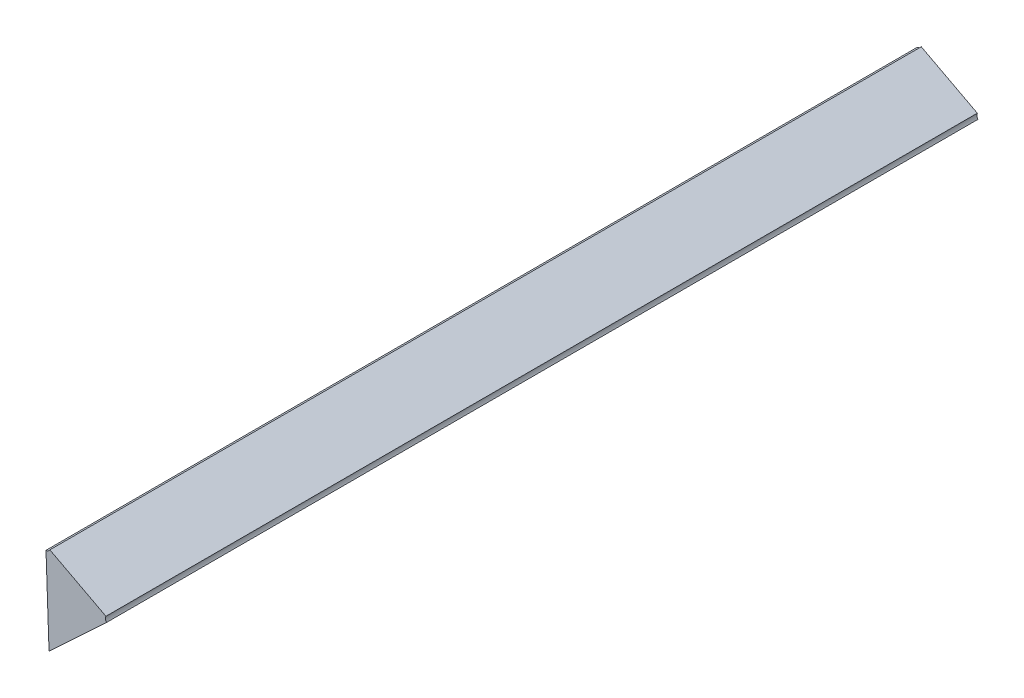
ISO-10303-21;
HEADER;
FILE_DESCRIPTION(('STEP AP214'),'2;1');
FILE_NAME('part.step','',(''),(''),'','','');
FILE_SCHEMA(('AUTOMOTIVE_DESIGN { 1 0 10303 214 1 1 1 1 }'));
ENDSEC;
DATA;
#1=APPLICATION_CONTEXT('core data for automotive mechanical design processes');
#2=APPLICATION_PROTOCOL_DEFINITION('international standard','automotive_design',2000,#1);
#3=PRODUCT_CONTEXT('',#1,'mechanical');
#4=PRODUCT('Part','Part','',(#3));
#5=PRODUCT_RELATED_PRODUCT_CATEGORY('part','',(#4));
#6=PRODUCT_DEFINITION_FORMATION('','',#4);
#7=PRODUCT_DEFINITION_CONTEXT('part definition',#1,'design');
#8=PRODUCT_DEFINITION('design','',#6,#7);
#9=PRODUCT_DEFINITION_SHAPE('','',#8);
#10=(LENGTH_UNIT() NAMED_UNIT(*) SI_UNIT(.MILLI.,.METRE.));
#11=(NAMED_UNIT(*) PLANE_ANGLE_UNIT() SI_UNIT($,.RADIAN.));
#12=(NAMED_UNIT(*) SI_UNIT($,.STERADIAN.) SOLID_ANGLE_UNIT());
#13=UNCERTAINTY_MEASURE_WITH_UNIT(LENGTH_MEASURE(1.E-05),#10,'distance_accuracy_value','');
#14=(GEOMETRIC_REPRESENTATION_CONTEXT(3) GLOBAL_UNCERTAINTY_ASSIGNED_CONTEXT((#13)) GLOBAL_UNIT_ASSIGNED_CONTEXT((#10,
#11,#12)) REPRESENTATION_CONTEXT('',''));
#15=CARTESIAN_POINT('',(0.,0.,0.));
#16=DIRECTION('',(0.,0.,1.));
#17=DIRECTION('',(1.,0.,0.));
#18=AXIS2_PLACEMENT_3D('',#15,#16,#17);
#19=CARTESIAN_POINT('',(-1.2992040822609,-0.38468925183984,0.));
#20=DIRECTION('',(0.,0.,-1.));
#21=DIRECTION('',(-1.,0.,0.));
#22=AXIS2_PLACEMENT_3D('',#19,#20,#21);
#23=PLANE('',#22);
#24=DIRECTION('',(0.,1.,0.));
#25=VECTOR('',#24,1.);
#26=CARTESIAN_POINT('',(-1.301513234463,-0.390354849213328,0.));
#27=LINE('',#26,#25);
#28=CARTESIAN_POINT('',(-1.3011633748782,-0.390006506078917,0.));
#29=VERTEX_POINT('',#28);
#30=CARTESIAN_POINT('',(-1.301513234463,-0.380147454767227,0.));
#31=VERTEX_POINT('',#30);
#32=EDGE_CURVE('E11',#29,#31,#27,.T.);
#33=ORIENTED_EDGE('',*,*,#32,.T.);
#34=CARTESIAN_POINT('',(-1.301513234463,-0.379647454767227,0.));
#35=DIRECTION('',(0.,0.,1.));
#36=DIRECTION('',(-1.,0.,0.));
#37=AXIS2_PLACEMENT_3D('',#34,#35,#36);
#38=CIRCLE('',#37,0.0005);
#39=CARTESIAN_POINT('',(-1.3010707147292,-0.379880212764161,0.));
#40=VERTEX_POINT('',#39);
#41=EDGE_CURVE('E24',#31,#40,#38,.T.);
#42=ORIENTED_EDGE('',*,*,#41,.T.);
#43=DIRECTION('',(0.885039467737861,-0.465515993867326,0.));
#44=VECTOR('',#43,1.);
#45=CARTESIAN_POINT('',(-1.301513234463,-0.379647454767227,0.));
#46=LINE('',#45,#44);
#47=CARTESIAN_POINT('',(-1.2946354673417,-0.383265045523118,0.));
#48=VERTEX_POINT('',#47);
#49=EDGE_CURVE('E133',#40,#48,#46,.T.);
#50=ORIENTED_EDGE('',*,*,#49,.T.);
#51=CARTESIAN_POINT('',(-1.2941929476078,-0.383497803520051,0.));
#52=DIRECTION('',(0.,0.,1.));
#53=DIRECTION('',(-1.,0.,0.));
#54=AXIS2_PLACEMENT_3D('',#51,#52,#53);
#55=CIRCLE('',#54,0.0005);
#56=CARTESIAN_POINT('',(-1.2945578585312,-0.383839622211744,0.));
#57=VERTEX_POINT('',#56);
#58=EDGE_CURVE('E131',#48,#57,#55,.T.);
#59=ORIENTED_EDGE('',*,*,#58,.T.);
#60=DIRECTION('',(-0.729821846781318,-0.683637383384427,0.));
#61=VECTOR('',#60,1.);
#62=CARTESIAN_POINT('',(-1.2941929476078,-0.383497803520051,0.));
#63=LINE('',#62,#61);
#64=EDGE_CURVE('E127',#57,#29,#63,.T.);
#65=ORIENTED_EDGE('',*,*,#64,.T.);
#66=EDGE_LOOP('',(#33,#42,#50,#59,#65));
#67=FACE_BOUND('',#66,.T.);
#68=ADVANCED_FACE('F17',(#67),#23,.T.);
#69=CARTESIAN_POINT('',(-1.301513234463,-0.379647454767227,0.));
#70=DIRECTION('',(-0.465515993867326,-0.885039467737861,0.));
#71=DIRECTION('',(0.885039467737861,-0.465515993867326,0.));
#72=AXIS2_PLACEMENT_3D('',#69,#70,#71);
#73=PLANE('',#72);
#74=DIRECTION('',(0.,0.,-1.));
#75=VECTOR('',#74,1.);
#76=CARTESIAN_POINT('',(-1.2946354673417,-0.383265045523118,0.1));
#77=LINE('',#76,#75);
#78=CARTESIAN_POINT('',(-1.2946354673417,-0.383265045523118,0.1));
#79=VERTEX_POINT('',#78);
#80=EDGE_CURVE('E124',#79,#48,#77,.T.);
#81=ORIENTED_EDGE('',*,*,#80,.T.);
#82=ORIENTED_EDGE('',*,*,#49,.F.);
#83=DIRECTION('',(0.,0.,1.));
#84=VECTOR('',#83,1.);
#85=CARTESIAN_POINT('',(-1.3010707147292,-0.379880212764161,0.1));
#86=LINE('',#85,#84);
#87=CARTESIAN_POINT('',(-1.3010707147292,-0.379880212764161,0.1));
#88=VERTEX_POINT('',#87);
#89=EDGE_CURVE('E122',#40,#88,#86,.T.);
#90=ORIENTED_EDGE('',*,*,#89,.T.);
#91=DIRECTION('',(0.885039467737861,-0.465515993867326,0.));
#92=VECTOR('',#91,1.);
#93=CARTESIAN_POINT('',(-1.301513234463,-0.379647454767227,0.1));
#94=LINE('',#93,#92);
#95=EDGE_CURVE('E81',#88,#79,#94,.T.);
#96=ORIENTED_EDGE('',*,*,#95,.T.);
#97=EDGE_LOOP('',(#81,#82,#90,#96));
#98=FACE_BOUND('',#97,.T.);
#99=ADVANCED_FACE('F109',(#98),#73,.F.);
#100=CARTESIAN_POINT('',(-1.2941929476078,-0.383497803520051,0.));
#101=DIRECTION('',(-0.683637383384427,0.729821846781318,0.));
#102=DIRECTION('',(-0.729821846781318,-0.683637383384427,0.));
#103=AXIS2_PLACEMENT_3D('',#100,#101,#102);
#104=PLANE('',#103);
#105=CARTESIAN_POINT('',(-1.30114832353963,-0.390013030521632,0.1));
#106=DIRECTION('',(0.,0.,-1.));
#107=VECTOR('',#106,1.);
#108=LINE('',#105,#107);
#109=CARTESIAN_POINT('',(-1.3011633748782,-0.390006506078917,0.1));
#110=VERTEX_POINT('',#109);
#111=EDGE_CURVE('E70',#110,#29,#108,.T.);
#112=ORIENTED_EDGE('',*,*,#111,.T.);
#113=ORIENTED_EDGE('',*,*,#64,.F.);
#114=DIRECTION('',(0.,0.,1.));
#115=VECTOR('',#114,1.);
#116=CARTESIAN_POINT('',(-1.2945578585312,-0.383839622211744,0.1));
#117=LINE('',#116,#115);
#118=CARTESIAN_POINT('',(-1.2945578585312,-0.383839622211744,0.1));
#119=VERTEX_POINT('',#118);
#120=EDGE_CURVE('E90',#57,#119,#117,.T.);
#121=ORIENTED_EDGE('',*,*,#120,.T.);
#122=DIRECTION('',(-0.729821846781318,-0.683637383384427,0.));
#123=VECTOR('',#122,1.);
#124=CARTESIAN_POINT('',(-1.2941929476078,-0.383497803520051,0.1));
#125=LINE('',#124,#123);
#126=EDGE_CURVE('E75',#119,#110,#125,.T.);
#127=ORIENTED_EDGE('',*,*,#126,.T.);
#128=EDGE_LOOP('',(#112,#113,#121,#127));
#129=FACE_BOUND('',#128,.T.);
#130=ADVANCED_FACE('F105',(#129),#104,.F.);
#131=CARTESIAN_POINT('',(-1.301513234463,-0.390354849213328,0.));
#132=DIRECTION('',(1.,0.,0.));
#133=DIRECTION('',(0.,1.,0.));
#134=AXIS2_PLACEMENT_3D('',#131,#132,#133);
#135=PLANE('',#134);
#136=ORIENTED_EDGE('',*,*,#111,.F.);
#137=DIRECTION('',(0.,1.,0.));
#138=VECTOR('',#137,1.);
#139=CARTESIAN_POINT('',(-1.301513234463,-0.390354849213328,0.1));
#140=LINE('',#139,#138);
#141=CARTESIAN_POINT('',(-1.301513234463,-0.380147454767227,0.1));
#142=VERTEX_POINT('',#141);
#143=EDGE_CURVE('E64',#110,#142,#140,.T.);
#144=ORIENTED_EDGE('',*,*,#143,.T.);
#145=DIRECTION('',(0.,0.,-1.));
#146=VECTOR('',#145,1.);
#147=CARTESIAN_POINT('',(-1.301513234463,-0.380147454767227,0.1));
#148=LINE('',#147,#146);
#149=EDGE_CURVE('E58',#142,#31,#148,.T.);
#150=ORIENTED_EDGE('',*,*,#149,.T.);
#151=ORIENTED_EDGE('',*,*,#32,.F.);
#152=EDGE_LOOP('',(#136,#144,#150,#151));
#153=FACE_BOUND('',#152,.T.);
#154=ADVANCED_FACE('F68',(#153),#135,.F.);
#155=CARTESIAN_POINT('',(-1.2992040822609,-0.38468925183984,0.1));
#156=DIRECTION('',(0.,0.,-1.));
#157=DIRECTION('',(-1.,0.,0.));
#158=AXIS2_PLACEMENT_3D('',#155,#156,#157);
#159=PLANE('',#158);
#160=ORIENTED_EDGE('',*,*,#126,.F.);
#161=CARTESIAN_POINT('',(-1.2941929476078,-0.383497803520051,0.1));
#162=DIRECTION('',(0.,0.,-1.));
#163=DIRECTION('',(-1.,0.,0.));
#164=AXIS2_PLACEMENT_3D('',#161,#162,#163);
#165=CIRCLE('',#164,0.0005);
#166=EDGE_CURVE('E65',#119,#79,#165,.T.);
#167=ORIENTED_EDGE('',*,*,#166,.T.);
#168=ORIENTED_EDGE('',*,*,#95,.F.);
#169=CARTESIAN_POINT('',(-1.301513234463,-0.379647454767227,0.1));
#170=DIRECTION('',(0.,0.,-1.));
#171=DIRECTION('',(-1.,0.,0.));
#172=AXIS2_PLACEMENT_3D('',#169,#170,#171);
#173=CIRCLE('',#172,0.0005);
#174=EDGE_CURVE('E63',#88,#142,#173,.T.);
#175=ORIENTED_EDGE('',*,*,#174,.T.);
#176=ORIENTED_EDGE('',*,*,#143,.F.);
#177=EDGE_LOOP('',(#160,#167,#168,#175,#176));
#178=FACE_BOUND('',#177,.T.);
#179=ADVANCED_FACE('F78',(#178),#159,.F.);
#180=CARTESIAN_POINT('',(-1.301513234463,-0.379647454767227,0.1));
#181=DIRECTION('',(0.,0.,1.));
#182=DIRECTION('',(-1.,0.,0.));
#183=AXIS2_PLACEMENT_3D('',#180,#181,#182);
#184=CYLINDRICAL_SURFACE('',#183,0.0005);
#185=ORIENTED_EDGE('',*,*,#89,.F.);
#186=ORIENTED_EDGE('',*,*,#41,.F.);
#187=ORIENTED_EDGE('',*,*,#149,.F.);
#188=ORIENTED_EDGE('',*,*,#174,.F.);
#189=EDGE_LOOP('',(#185,#186,#187,#188));
#190=FACE_BOUND('',#189,.T.);
#191=ADVANCED_FACE('F61',(#190),#184,.F.);
#192=CARTESIAN_POINT('',(-1.2941929476078,-0.383497803520051,0.1));
#193=DIRECTION('',(0.,0.,1.));
#194=DIRECTION('',(-1.,0.,0.));
#195=AXIS2_PLACEMENT_3D('',#192,#193,#194);
#196=CYLINDRICAL_SURFACE('',#195,0.0005);
#197=ORIENTED_EDGE('',*,*,#80,.F.);
#198=ORIENTED_EDGE('',*,*,#166,.F.);
#199=ORIENTED_EDGE('',*,*,#120,.F.);
#200=ORIENTED_EDGE('',*,*,#58,.F.);
#201=EDGE_LOOP('',(#197,#198,#199,#200));
#202=FACE_BOUND('',#201,.T.);
#203=ADVANCED_FACE('F141',(#202),#196,.F.);
#204=CLOSED_SHELL('',(#68,#99,#130,#154,#179,#191,#203));
#205=MANIFOLD_SOLID_BREP('B1',#204);
#206=ADVANCED_BREP_SHAPE_REPRESENTATION('',(#18,#205),#14);
#207=SHAPE_DEFINITION_REPRESENTATION(#9,#206);
ENDSEC;
END-ISO-10303-21;
